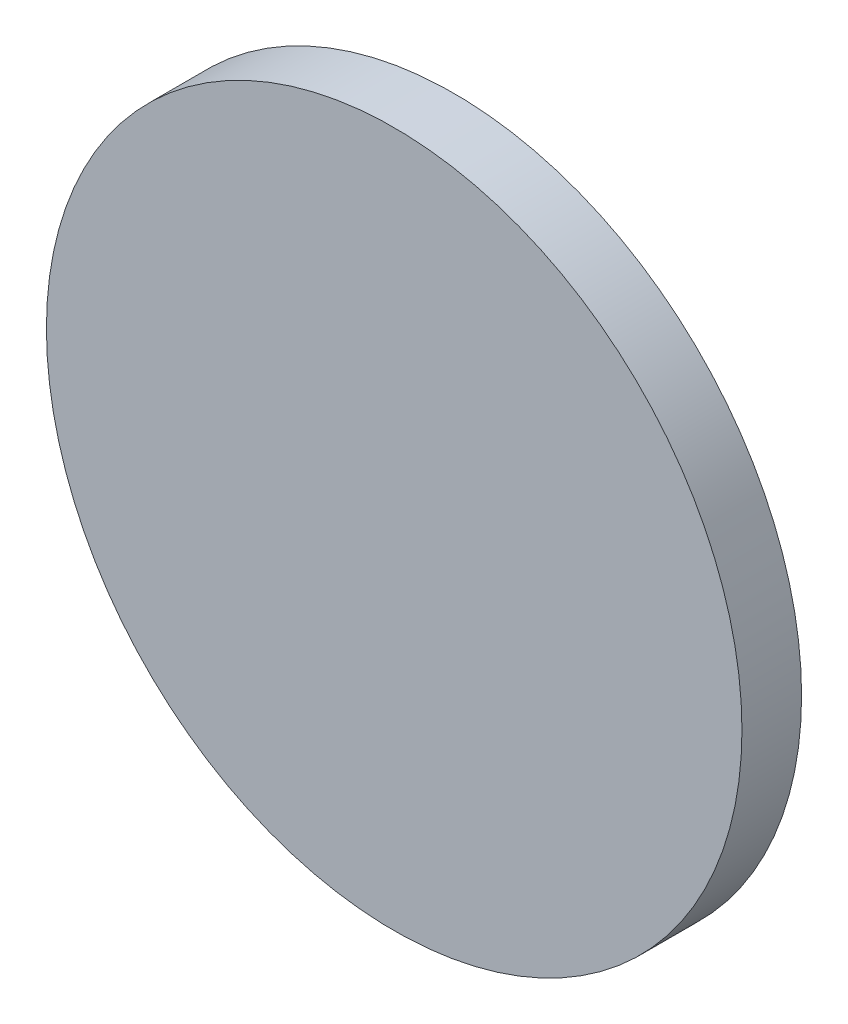
ISO-10303-21;
HEADER;
FILE_DESCRIPTION(('STEP AP214'),'2;1');
FILE_NAME('part.step','',(''),(''),'','','');
FILE_SCHEMA(('AUTOMOTIVE_DESIGN { 1 0 10303 214 1 1 1 1 }'));
ENDSEC;
DATA;
#1=APPLICATION_CONTEXT('core data for automotive mechanical design processes');
#2=APPLICATION_PROTOCOL_DEFINITION('international standard','automotive_design',2000,#1);
#3=PRODUCT_CONTEXT('',#1,'mechanical');
#4=PRODUCT('Part','Part','',(#3));
#5=PRODUCT_RELATED_PRODUCT_CATEGORY('part','',(#4));
#6=PRODUCT_DEFINITION_FORMATION('','',#4);
#7=PRODUCT_DEFINITION_CONTEXT('part definition',#1,'design');
#8=PRODUCT_DEFINITION('design','',#6,#7);
#9=PRODUCT_DEFINITION_SHAPE('','',#8);
#10=(LENGTH_UNIT() NAMED_UNIT(*) SI_UNIT(.MILLI.,.METRE.));
#11=(NAMED_UNIT(*) PLANE_ANGLE_UNIT() SI_UNIT($,.RADIAN.));
#12=(NAMED_UNIT(*) SI_UNIT($,.STERADIAN.) SOLID_ANGLE_UNIT());
#13=UNCERTAINTY_MEASURE_WITH_UNIT(LENGTH_MEASURE(1.E-05),#10,'distance_accuracy_value','');
#14=(GEOMETRIC_REPRESENTATION_CONTEXT(3) GLOBAL_UNCERTAINTY_ASSIGNED_CONTEXT((#13)) GLOBAL_UNIT_ASSIGNED_CONTEXT((#10,
#11,#12)) REPRESENTATION_CONTEXT('',''));
#15=CARTESIAN_POINT('',(0.,0.,0.));
#16=DIRECTION('',(0.,0.,1.));
#17=DIRECTION('',(1.,0.,0.));
#18=AXIS2_PLACEMENT_3D('',#15,#16,#17);
#19=CARTESIAN_POINT('',(3.03022,2.329180006176,0.79916));
#20=DIRECTION('',(0.,0.,1.));
#21=DIRECTION('',(1.,0.,0.));
#22=AXIS2_PLACEMENT_3D('',#19,#20,#21);
#23=PLANE('',#22);
#24=CARTESIAN_POINT('',(3.03022,2.329180006176,0.79916));
#25=DIRECTION('',(0.,0.,1.));
#26=DIRECTION('',(1.,0.,0.));
#27=AXIS2_PLACEMENT_3D('',#24,#25,#26);
#28=CIRCLE('',#27,0.200024667);
#29=CARTESIAN_POINT('',(3.230244667,2.329180006176,0.79916));
#30=VERTEX_POINT('',#29);
#31=EDGE_CURVE('E18',#30,#30,#28,.F.);
#32=ORIENTED_EDGE('',*,*,#31,.F.);
#33=EDGE_LOOP('',(#32));
#34=FACE_BOUND('',#33,.T.);
#35=ADVANCED_FACE('F15',(#34),#23,.T.);
#36=CARTESIAN_POINT('',(3.03022,2.329180006176,0.76487));
#37=DIRECTION('',(0.,0.,1.));
#38=DIRECTION('',(1.,0.,0.));
#39=AXIS2_PLACEMENT_3D('',#36,#37,#38);
#40=CYLINDRICAL_SURFACE('',#39,0.200024667);
#41=ORIENTED_EDGE('',*,*,#31,.T.);
#42=EDGE_LOOP('',(#41));
#43=FACE_BOUND('',#42,.T.);
#44=CARTESIAN_POINT('',(3.03022,2.329180006176,0.76487));
#45=DIRECTION('',(0.,0.,1.));
#46=DIRECTION('',(1.,0.,0.));
#47=AXIS2_PLACEMENT_3D('',#44,#45,#46);
#48=CIRCLE('',#47,0.200024667);
#49=CARTESIAN_POINT('',(3.230244667,2.329180006176,0.76487));
#50=VERTEX_POINT('',#49);
#51=EDGE_CURVE('E10',#50,#50,#48,.F.);
#52=ORIENTED_EDGE('',*,*,#51,.F.);
#53=EDGE_LOOP('',(#52));
#54=FACE_BOUND('',#53,.T.);
#55=ADVANCED_FACE('F27',(#43,#54),#40,.T.);
#56=CARTESIAN_POINT('',(3.03022,2.329180006176,0.76487));
#57=DIRECTION('',(0.,0.,-1.));
#58=DIRECTION('',(-1.,0.,0.));
#59=AXIS2_PLACEMENT_3D('',#56,#57,#58);
#60=PLANE('',#59);
#61=ORIENTED_EDGE('',*,*,#51,.T.);
#62=EDGE_LOOP('',(#61));
#63=FACE_BOUND('',#62,.T.);
#64=ADVANCED_FACE('F35',(#63),#60,.T.);
#65=CLOSED_SHELL('',(#35,#55,#64));
#66=MANIFOLD_SOLID_BREP('B1',#65);
#67=ADVANCED_BREP_SHAPE_REPRESENTATION('',(#18,#66),#14);
#68=SHAPE_DEFINITION_REPRESENTATION(#9,#67);
ENDSEC;
END-ISO-10303-21;
